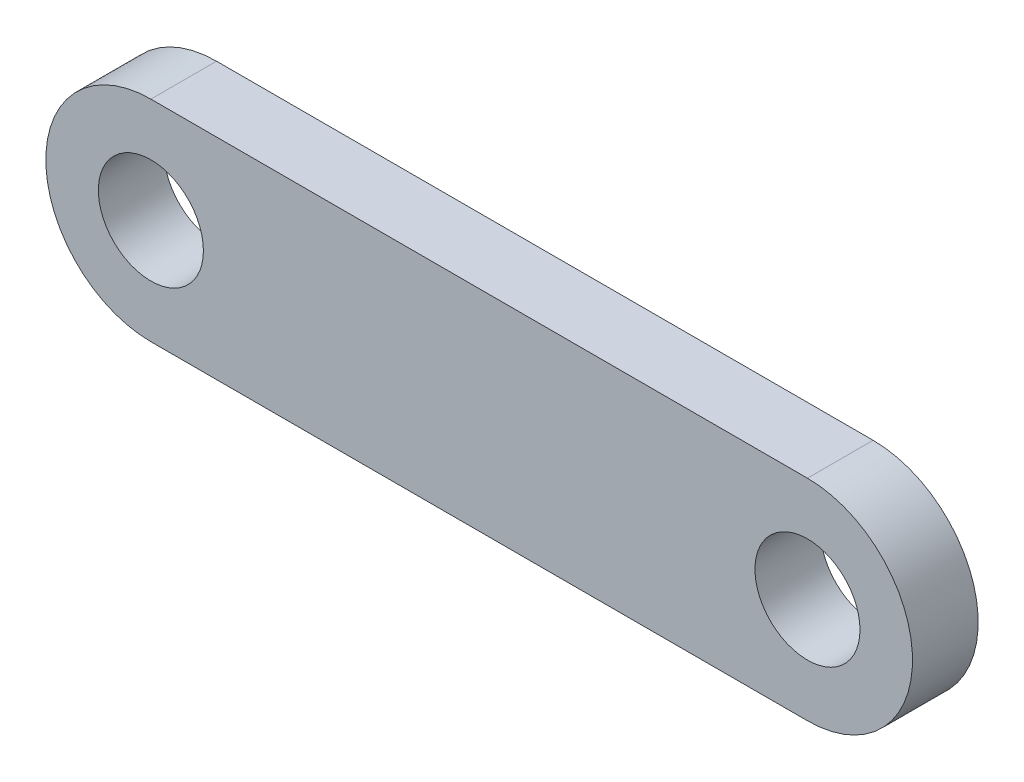
ISO-10303-21;
HEADER;
FILE_DESCRIPTION(('STEP AP214'),'2;1');
FILE_NAME('part.step','',(''),(''),'','','');
FILE_SCHEMA(('AUTOMOTIVE_DESIGN { 1 0 10303 214 1 1 1 1 }'));
ENDSEC;
DATA;
#1=APPLICATION_CONTEXT('core data for automotive mechanical design processes');
#2=APPLICATION_PROTOCOL_DEFINITION('international standard','automotive_design',2000,#1);
#3=PRODUCT_CONTEXT('',#1,'mechanical');
#4=PRODUCT('Part','Part','',(#3));
#5=PRODUCT_RELATED_PRODUCT_CATEGORY('part','',(#4));
#6=PRODUCT_DEFINITION_FORMATION('','',#4);
#7=PRODUCT_DEFINITION_CONTEXT('part definition',#1,'design');
#8=PRODUCT_DEFINITION('design','',#6,#7);
#9=PRODUCT_DEFINITION_SHAPE('','',#8);
#10=(LENGTH_UNIT() NAMED_UNIT(*) SI_UNIT(.MILLI.,.METRE.));
#11=(NAMED_UNIT(*) PLANE_ANGLE_UNIT() SI_UNIT($,.RADIAN.));
#12=(NAMED_UNIT(*) SI_UNIT($,.STERADIAN.) SOLID_ANGLE_UNIT());
#13=UNCERTAINTY_MEASURE_WITH_UNIT(LENGTH_MEASURE(1.E-05),#10,'distance_accuracy_value','');
#14=(GEOMETRIC_REPRESENTATION_CONTEXT(3) GLOBAL_UNCERTAINTY_ASSIGNED_CONTEXT((#13)) GLOBAL_UNIT_ASSIGNED_CONTEXT((#10,
#11,#12)) REPRESENTATION_CONTEXT('',''));
#15=CARTESIAN_POINT('',(0.,0.,0.));
#16=DIRECTION('',(0.,0.,1.));
#17=DIRECTION('',(1.,0.,0.));
#18=AXIS2_PLACEMENT_3D('',#15,#16,#17);
#19=CARTESIAN_POINT('',(0.,0.,-5.));
#20=DIRECTION('',(0.,0.,1.));
#21=DIRECTION('',(1.,0.,0.));
#22=AXIS2_PLACEMENT_3D('',#19,#20,#21);
#23=CYLINDRICAL_SURFACE('',#22,8.);
#24=CARTESIAN_POINT('',(0.,0.,0.));
#25=DIRECTION('',(0.,0.,1.));
#26=DIRECTION('',(1.,0.,0.));
#27=AXIS2_PLACEMENT_3D('',#24,#25,#26);
#28=CIRCLE('',#27,8.);
#29=CARTESIAN_POINT('',(0.,8.,0.));
#30=VERTEX_POINT('',#29);
#31=CARTESIAN_POINT('',(0.,-8.,0.));
#32=VERTEX_POINT('',#31);
#33=EDGE_CURVE('E107',#30,#32,#28,.T.);
#34=ORIENTED_EDGE('',*,*,#33,.F.);
#35=DIRECTION('',(0.,0.,1.));
#36=VECTOR('',#35,1.);
#37=CARTESIAN_POINT('',(0.,8.,-5.));
#38=LINE('',#37,#36);
#39=CARTESIAN_POINT('',(0.,8.,-5.));
#40=VERTEX_POINT('',#39);
#41=EDGE_CURVE('E13',#40,#30,#38,.T.);
#42=ORIENTED_EDGE('',*,*,#41,.F.);
#43=CARTESIAN_POINT('',(0.,0.,-5.));
#44=DIRECTION('',(0.,0.,1.));
#45=DIRECTION('',(1.,0.,0.));
#46=AXIS2_PLACEMENT_3D('',#43,#44,#45);
#47=CIRCLE('',#46,8.);
#48=CARTESIAN_POINT('',(0.,-8.,-5.));
#49=VERTEX_POINT('',#48);
#50=EDGE_CURVE('E100',#40,#49,#47,.T.);
#51=ORIENTED_EDGE('',*,*,#50,.T.);
#52=DIRECTION('',(0.,0.,1.));
#53=VECTOR('',#52,1.);
#54=CARTESIAN_POINT('',(0.,-8.,-5.));
#55=LINE('',#54,#53);
#56=EDGE_CURVE('E45',#49,#32,#55,.T.);
#57=ORIENTED_EDGE('',*,*,#56,.T.);
#58=EDGE_LOOP('',(#34,#42,#51,#57));
#59=FACE_BOUND('',#58,.T.);
#60=ADVANCED_FACE('F42',(#59),#23,.T.);
#61=CARTESIAN_POINT('',(0.,8.,-5.));
#62=DIRECTION('',(0.,1.,0.));
#63=DIRECTION('',(-1.,0.,0.));
#64=AXIS2_PLACEMENT_3D('',#61,#62,#63);
#65=PLANE('',#64);
#66=DIRECTION('',(-1.,0.,0.));
#67=VECTOR('',#66,1.);
#68=CARTESIAN_POINT('',(0.,8.,0.));
#69=LINE('',#68,#67);
#70=CARTESIAN_POINT('',(50.,8.,0.));
#71=VERTEX_POINT('',#70);
#72=EDGE_CURVE('E102',#71,#30,#69,.T.);
#73=ORIENTED_EDGE('',*,*,#72,.F.);
#74=DIRECTION('',(0.,0.,1.));
#75=VECTOR('',#74,1.);
#76=CARTESIAN_POINT('',(50.,8.,-5.));
#77=LINE('',#76,#75);
#78=CARTESIAN_POINT('',(50.,8.,-5.));
#79=VERTEX_POINT('',#78);
#80=EDGE_CURVE('E51',#79,#71,#77,.T.);
#81=ORIENTED_EDGE('',*,*,#80,.F.);
#82=DIRECTION('',(-1.,0.,0.));
#83=VECTOR('',#82,1.);
#84=CARTESIAN_POINT('',(0.,8.,-5.));
#85=LINE('',#84,#83);
#86=EDGE_CURVE('E97',#79,#40,#85,.T.);
#87=ORIENTED_EDGE('',*,*,#86,.T.);
#88=ORIENTED_EDGE('',*,*,#41,.T.);
#89=EDGE_LOOP('',(#73,#81,#87,#88));
#90=FACE_BOUND('',#89,.T.);
#91=ADVANCED_FACE('F118',(#90),#65,.T.);
#92=CARTESIAN_POINT('',(50.,0.,-5.));
#93=DIRECTION('',(0.,0.,1.));
#94=DIRECTION('',(1.,0.,0.));
#95=AXIS2_PLACEMENT_3D('',#92,#93,#94);
#96=CYLINDRICAL_SURFACE('',#95,8.);
#97=CARTESIAN_POINT('',(50.,0.,0.));
#98=DIRECTION('',(0.,0.,1.));
#99=DIRECTION('',(1.,0.,0.));
#100=AXIS2_PLACEMENT_3D('',#97,#98,#99);
#101=CIRCLE('',#100,8.);
#102=CARTESIAN_POINT('',(50.,-8.,0.));
#103=VERTEX_POINT('',#102);
#104=EDGE_CURVE('E92',#103,#71,#101,.T.);
#105=ORIENTED_EDGE('',*,*,#104,.F.);
#106=DIRECTION('',(0.,0.,1.));
#107=VECTOR('',#106,1.);
#108=CARTESIAN_POINT('',(50.,-8.,-5.));
#109=LINE('',#108,#107);
#110=CARTESIAN_POINT('',(50.,-8.,-5.));
#111=VERTEX_POINT('',#110);
#112=EDGE_CURVE('E87',#111,#103,#109,.T.);
#113=ORIENTED_EDGE('',*,*,#112,.F.);
#114=CARTESIAN_POINT('',(50.,0.,-5.));
#115=DIRECTION('',(0.,0.,1.));
#116=DIRECTION('',(1.,0.,0.));
#117=AXIS2_PLACEMENT_3D('',#114,#115,#116);
#118=CIRCLE('',#117,8.);
#119=EDGE_CURVE('E90',#111,#79,#118,.T.);
#120=ORIENTED_EDGE('',*,*,#119,.T.);
#121=ORIENTED_EDGE('',*,*,#80,.T.);
#122=EDGE_LOOP('',(#105,#113,#120,#121));
#123=FACE_BOUND('',#122,.T.);
#124=ADVANCED_FACE('F89',(#123),#96,.T.);
#125=CARTESIAN_POINT('',(0.,-8.,-5.));
#126=DIRECTION('',(0.,-1.,0.));
#127=DIRECTION('',(0.,0.,-1.));
#128=AXIS2_PLACEMENT_3D('',#125,#126,#127);
#129=PLANE('',#128);
#130=DIRECTION('',(1.,0.,0.));
#131=VECTOR('',#130,1.);
#132=CARTESIAN_POINT('',(0.,-8.,0.));
#133=LINE('',#132,#131);
#134=EDGE_CURVE('E110',#32,#103,#133,.T.);
#135=ORIENTED_EDGE('',*,*,#134,.F.);
#136=ORIENTED_EDGE('',*,*,#56,.F.);
#137=DIRECTION('',(1.,0.,0.));
#138=VECTOR('',#137,1.);
#139=CARTESIAN_POINT('',(0.,-8.,-5.));
#140=LINE('',#139,#138);
#141=EDGE_CURVE('E96',#49,#111,#140,.T.);
#142=ORIENTED_EDGE('',*,*,#141,.T.);
#143=ORIENTED_EDGE('',*,*,#112,.T.);
#144=EDGE_LOOP('',(#135,#136,#142,#143));
#145=FACE_BOUND('',#144,.T.);
#146=ADVANCED_FACE('F99',(#145),#129,.T.);
#147=CARTESIAN_POINT('',(0.,0.,-5.));
#148=DIRECTION('',(0.,0.,1.));
#149=DIRECTION('',(1.,0.,0.));
#150=AXIS2_PLACEMENT_3D('',#147,#148,#149);
#151=PLANE('',#150);
#152=CARTESIAN_POINT('',(50.,0.,-5.));
#153=DIRECTION('',(0.,0.,1.));
#154=DIRECTION('',(1.,0.,0.));
#155=AXIS2_PLACEMENT_3D('',#152,#153,#154);
#156=CIRCLE('',#155,4.);
#157=CARTESIAN_POINT('',(54.,0.,-5.));
#158=VERTEX_POINT('',#157);
#159=EDGE_CURVE('E151',#158,#158,#156,.T.);
#160=ORIENTED_EDGE('',*,*,#159,.T.);
#161=EDGE_LOOP('',(#160));
#162=FACE_BOUND('',#161,.T.);
#163=CARTESIAN_POINT('',(0.,0.,-5.));
#164=DIRECTION('',(0.,0.,1.));
#165=DIRECTION('',(1.,0.,0.));
#166=AXIS2_PLACEMENT_3D('',#163,#164,#165);
#167=CIRCLE('',#166,4.);
#168=CARTESIAN_POINT('',(4.,0.,-5.));
#169=VERTEX_POINT('',#168);
#170=EDGE_CURVE('E111',#169,#169,#167,.T.);
#171=ORIENTED_EDGE('',*,*,#170,.T.);
#172=EDGE_LOOP('',(#171));
#173=FACE_BOUND('',#172,.T.);
#174=ORIENTED_EDGE('',*,*,#50,.F.);
#175=ORIENTED_EDGE('',*,*,#86,.F.);
#176=ORIENTED_EDGE('',*,*,#119,.F.);
#177=ORIENTED_EDGE('',*,*,#141,.F.);
#178=EDGE_LOOP('',(#174,#175,#176,#177));
#179=FACE_BOUND('',#178,.T.);
#180=ADVANCED_FACE('F95',(#162,#173,#179),#151,.F.);
#181=CARTESIAN_POINT('',(0.,0.,0.));
#182=DIRECTION('',(0.,0.,1.));
#183=DIRECTION('',(1.,0.,0.));
#184=AXIS2_PLACEMENT_3D('',#181,#182,#183);
#185=PLANE('',#184);
#186=CARTESIAN_POINT('',(50.,0.,0.));
#187=DIRECTION('',(0.,0.,1.));
#188=DIRECTION('',(1.,0.,0.));
#189=AXIS2_PLACEMENT_3D('',#186,#187,#188);
#190=CIRCLE('',#189,4.);
#191=CARTESIAN_POINT('',(54.,0.,0.));
#192=VERTEX_POINT('',#191);
#193=EDGE_CURVE('E154',#192,#192,#190,.T.);
#194=ORIENTED_EDGE('',*,*,#193,.F.);
#195=EDGE_LOOP('',(#194));
#196=FACE_BOUND('',#195,.T.);
#197=CARTESIAN_POINT('',(0.,0.,0.));
#198=DIRECTION('',(0.,0.,1.));
#199=DIRECTION('',(1.,0.,0.));
#200=AXIS2_PLACEMENT_3D('',#197,#198,#199);
#201=CIRCLE('',#200,4.);
#202=CARTESIAN_POINT('',(4.,0.,0.));
#203=VERTEX_POINT('',#202);
#204=EDGE_CURVE('E156',#203,#203,#201,.T.);
#205=ORIENTED_EDGE('',*,*,#204,.F.);
#206=EDGE_LOOP('',(#205));
#207=FACE_BOUND('',#206,.T.);
#208=ORIENTED_EDGE('',*,*,#33,.T.);
#209=ORIENTED_EDGE('',*,*,#134,.T.);
#210=ORIENTED_EDGE('',*,*,#104,.T.);
#211=ORIENTED_EDGE('',*,*,#72,.T.);
#212=EDGE_LOOP('',(#208,#209,#210,#211));
#213=FACE_BOUND('',#212,.T.);
#214=ADVANCED_FACE('F117',(#196,#207,#213),#185,.T.);
#215=CARTESIAN_POINT('',(0.,0.,-5.));
#216=DIRECTION('',(0.,0.,1.));
#217=DIRECTION('',(1.,0.,0.));
#218=AXIS2_PLACEMENT_3D('',#215,#216,#217);
#219=CYLINDRICAL_SURFACE('',#218,4.);
#220=ORIENTED_EDGE('',*,*,#170,.F.);
#221=EDGE_LOOP('',(#220));
#222=FACE_BOUND('',#221,.T.);
#223=ORIENTED_EDGE('',*,*,#204,.T.);
#224=EDGE_LOOP('',(#223));
#225=FACE_BOUND('',#224,.T.);
#226=ADVANCED_FACE('F136',(#222,#225),#219,.F.);
#227=CARTESIAN_POINT('',(50.,0.,-5.));
#228=DIRECTION('',(0.,0.,1.));
#229=DIRECTION('',(1.,0.,0.));
#230=AXIS2_PLACEMENT_3D('',#227,#228,#229);
#231=CYLINDRICAL_SURFACE('',#230,4.);
#232=ORIENTED_EDGE('',*,*,#159,.F.);
#233=EDGE_LOOP('',(#232));
#234=FACE_BOUND('',#233,.T.);
#235=ORIENTED_EDGE('',*,*,#193,.T.);
#236=EDGE_LOOP('',(#235));
#237=FACE_BOUND('',#236,.T.);
#238=ADVANCED_FACE('F143',(#234,#237),#231,.F.);
#239=CLOSED_SHELL('',(#60,#91,#124,#146,#180,#214,#226,#238));
#240=MANIFOLD_SOLID_BREP('B2',#239);
#241=ADVANCED_BREP_SHAPE_REPRESENTATION('',(#18,#240),#14);
#242=SHAPE_DEFINITION_REPRESENTATION(#9,#241);
ENDSEC;
END-ISO-10303-21;
